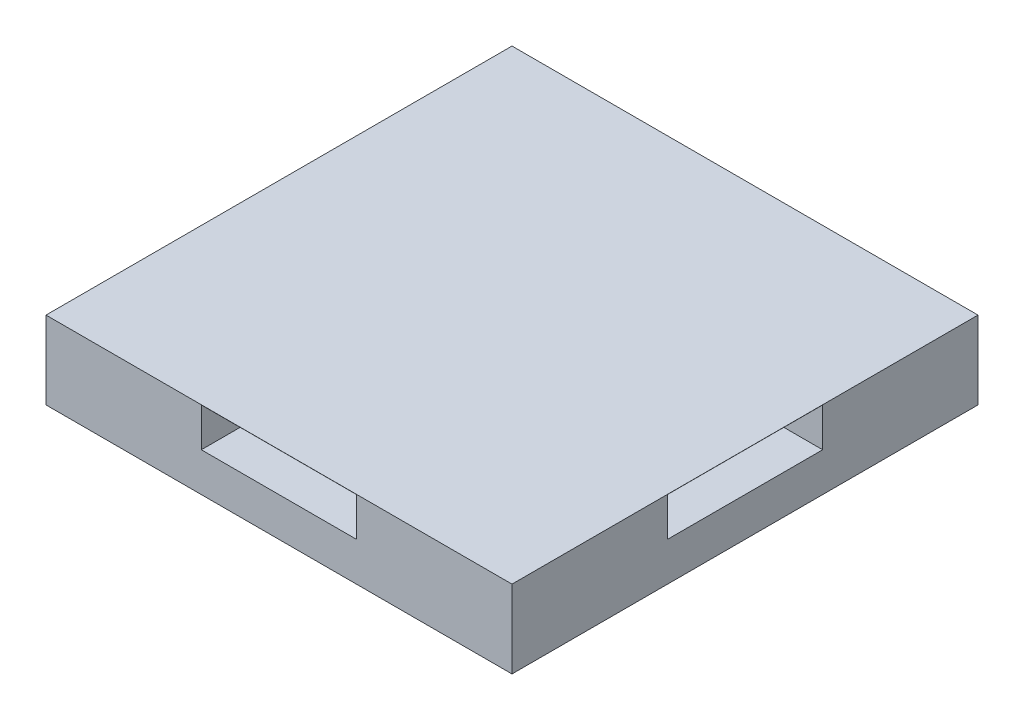
ISO-10303-21;
HEADER;
FILE_DESCRIPTION(('STEP AP214'),'2;1');
FILE_NAME('part.step','',(''),(''),'','','');
FILE_SCHEMA(('AUTOMOTIVE_DESIGN { 1 0 10303 214 1 1 1 1 }'));
ENDSEC;
DATA;
#1=APPLICATION_CONTEXT('core data for automotive mechanical design processes');
#2=APPLICATION_PROTOCOL_DEFINITION('international standard','automotive_design',2000,#1);
#3=PRODUCT_CONTEXT('',#1,'mechanical');
#4=PRODUCT('Part','Part','',(#3));
#5=PRODUCT_RELATED_PRODUCT_CATEGORY('part','',(#4));
#6=PRODUCT_DEFINITION_FORMATION('','',#4);
#7=PRODUCT_DEFINITION_CONTEXT('part definition',#1,'design');
#8=PRODUCT_DEFINITION('design','',#6,#7);
#9=PRODUCT_DEFINITION_SHAPE('','',#8);
#10=(LENGTH_UNIT() NAMED_UNIT(*) SI_UNIT(.MILLI.,.METRE.));
#11=(NAMED_UNIT(*) PLANE_ANGLE_UNIT() SI_UNIT($,.RADIAN.));
#12=(NAMED_UNIT(*) SI_UNIT($,.STERADIAN.) SOLID_ANGLE_UNIT());
#13=UNCERTAINTY_MEASURE_WITH_UNIT(LENGTH_MEASURE(1.E-05),#10,'distance_accuracy_value','');
#14=(GEOMETRIC_REPRESENTATION_CONTEXT(3) GLOBAL_UNCERTAINTY_ASSIGNED_CONTEXT((#13)) GLOBAL_UNIT_ASSIGNED_CONTEXT((#10,
#11,#12)) REPRESENTATION_CONTEXT('',''));
#15=CARTESIAN_POINT('',(0.,0.,0.));
#16=DIRECTION('',(0.,0.,1.));
#17=DIRECTION('',(1.,0.,0.));
#18=AXIS2_PLACEMENT_3D('',#15,#16,#17);
#19=CARTESIAN_POINT('',(0.,12.7,0.));
#20=DIRECTION('',(1.,0.,0.));
#21=DIRECTION('',(0.,0.,-1.));
#22=AXIS2_PLACEMENT_3D('',#19,#20,#21);
#23=PLANE('',#22);
#24=DIRECTION('',(0.,1.,0.));
#25=VECTOR('',#24,1.);
#26=CARTESIAN_POINT('',(0.,6.35,-50.8));
#27=LINE('',#26,#25);
#28=CARTESIAN_POINT('',(0.,6.35,-50.8));
#29=VERTEX_POINT('',#28);
#30=CARTESIAN_POINT('',(0.,12.7,-50.8));
#31=VERTEX_POINT('',#30);
#32=EDGE_CURVE('E255',#29,#31,#27,.T.);
#33=ORIENTED_EDGE('',*,*,#32,.T.);
#34=DIRECTION('',(0.,0.,1.));
#35=VECTOR('',#34,1.);
#36=CARTESIAN_POINT('',(0.,12.7,-76.2));
#37=LINE('',#36,#35);
#38=CARTESIAN_POINT('',(0.,12.7,-25.4));
#39=VERTEX_POINT('',#38);
#40=EDGE_CURVE('E203',#31,#39,#37,.T.);
#41=ORIENTED_EDGE('',*,*,#40,.T.);
#42=DIRECTION('',(0.,1.,0.));
#43=VECTOR('',#42,1.);
#44=CARTESIAN_POINT('',(0.,6.35,-25.4));
#45=LINE('',#44,#43);
#46=CARTESIAN_POINT('',(0.,6.35,-25.4));
#47=VERTEX_POINT('',#46);
#48=EDGE_CURVE('E245',#47,#39,#45,.T.);
#49=ORIENTED_EDGE('',*,*,#48,.F.);
#50=DIRECTION('',(0.,0.,1.));
#51=VECTOR('',#50,1.);
#52=CARTESIAN_POINT('',(0.,6.35,-50.8));
#53=LINE('',#52,#51);
#54=EDGE_CURVE('E263',#29,#47,#53,.T.);
#55=ORIENTED_EDGE('',*,*,#54,.F.);
#56=EDGE_LOOP('',(#33,#41,#49,#55));
#57=FACE_BOUND('',#56,.T.);
#58=DIRECTION('',(0.,0.,1.));
#59=VECTOR('',#58,1.);
#60=CARTESIAN_POINT('',(0.,12.7254,-76.2));
#61=LINE('',#60,#59);
#62=CARTESIAN_POINT('',(0.,12.7254,-76.2));
#63=VERTEX_POINT('',#62);
#64=CARTESIAN_POINT('',(0.,12.7254,0.));
#65=VERTEX_POINT('',#64);
#66=EDGE_CURVE('E178',#63,#65,#61,.T.);
#67=ORIENTED_EDGE('',*,*,#66,.F.);
#68=DIRECTION('',(0.,-1.,0.));
#69=VECTOR('',#68,1.);
#70=CARTESIAN_POINT('',(0.,12.7,-76.2));
#71=LINE('',#70,#69);
#72=CARTESIAN_POINT('',(0.,0.,-76.2));
#73=VERTEX_POINT('',#72);
#74=EDGE_CURVE('E347',#63,#73,#71,.T.);
#75=ORIENTED_EDGE('',*,*,#74,.T.);
#76=DIRECTION('',(0.,0.,1.));
#77=VECTOR('',#76,1.);
#78=CARTESIAN_POINT('',(0.,0.,0.));
#79=LINE('',#78,#77);
#80=CARTESIAN_POINT('',(0.,0.,0.));
#81=VERTEX_POINT('',#80);
#82=EDGE_CURVE('E180',#73,#81,#79,.T.);
#83=ORIENTED_EDGE('',*,*,#82,.T.);
#84=DIRECTION('',(0.,-1.,0.));
#85=VECTOR('',#84,1.);
#86=CARTESIAN_POINT('',(0.,12.7,0.));
#87=LINE('',#86,#85);
#88=EDGE_CURVE('E11',#65,#81,#87,.T.);
#89=ORIENTED_EDGE('',*,*,#88,.F.);
#90=EDGE_LOOP('',(#67,#75,#83,#89));
#91=FACE_BOUND('',#90,.T.);
#92=ADVANCED_FACE('F39',(#57,#91),#23,.F.);
#93=CARTESIAN_POINT('',(0.,12.7,0.));
#94=DIRECTION('',(0.,0.,-1.));
#95=DIRECTION('',(-1.,0.,0.));
#96=AXIS2_PLACEMENT_3D('',#93,#94,#95);
#97=PLANE('',#96);
#98=DIRECTION('',(0.,1.,0.));
#99=VECTOR('',#98,1.);
#100=CARTESIAN_POINT('',(25.4,6.35,0.));
#101=LINE('',#100,#99);
#102=CARTESIAN_POINT('',(25.4,6.35,0.));
#103=VERTEX_POINT('',#102);
#104=CARTESIAN_POINT('',(25.4,12.7,0.));
#105=VERTEX_POINT('',#104);
#106=EDGE_CURVE('E278',#103,#105,#101,.T.);
#107=ORIENTED_EDGE('',*,*,#106,.T.);
#108=DIRECTION('',(1.,0.,0.));
#109=VECTOR('',#108,1.);
#110=CARTESIAN_POINT('',(0.,12.7,0.));
#111=LINE('',#110,#109);
#112=CARTESIAN_POINT('',(50.8,12.7,0.));
#113=VERTEX_POINT('',#112);
#114=EDGE_CURVE('E206',#105,#113,#111,.T.);
#115=ORIENTED_EDGE('',*,*,#114,.T.);
#116=DIRECTION('',(0.,1.,0.));
#117=VECTOR('',#116,1.);
#118=CARTESIAN_POINT('',(50.8,6.35,0.));
#119=LINE('',#118,#117);
#120=CARTESIAN_POINT('',(50.8,6.35,0.));
#121=VERTEX_POINT('',#120);
#122=EDGE_CURVE('E282',#121,#113,#119,.T.);
#123=ORIENTED_EDGE('',*,*,#122,.F.);
#124=DIRECTION('',(1.,0.,0.));
#125=VECTOR('',#124,1.);
#126=CARTESIAN_POINT('',(25.4,6.35,0.));
#127=LINE('',#126,#125);
#128=EDGE_CURVE('E306',#103,#121,#127,.T.);
#129=ORIENTED_EDGE('',*,*,#128,.F.);
#130=EDGE_LOOP('',(#107,#115,#123,#129));
#131=FACE_BOUND('',#130,.T.);
#132=DIRECTION('',(1.,0.,0.));
#133=VECTOR('',#132,1.);
#134=CARTESIAN_POINT('',(0.,12.7254,0.));
#135=LINE('',#134,#133);
#136=CARTESIAN_POINT('',(76.2,12.7254,0.));
#137=VERTEX_POINT('',#136);
#138=EDGE_CURVE('E183',#65,#137,#135,.T.);
#139=ORIENTED_EDGE('',*,*,#138,.F.);
#140=ORIENTED_EDGE('',*,*,#88,.T.);
#141=DIRECTION('',(1.,0.,0.));
#142=VECTOR('',#141,1.);
#143=CARTESIAN_POINT('',(0.,0.,0.));
#144=LINE('',#143,#142);
#145=CARTESIAN_POINT('',(76.2,0.,0.));
#146=VERTEX_POINT('',#145);
#147=EDGE_CURVE('E343',#81,#146,#144,.T.);
#148=ORIENTED_EDGE('',*,*,#147,.T.);
#149=DIRECTION('',(0.,-1.,0.));
#150=VECTOR('',#149,1.);
#151=CARTESIAN_POINT('',(76.2,12.7,0.));
#152=LINE('',#151,#150);
#153=EDGE_CURVE('E46',#137,#146,#152,.T.);
#154=ORIENTED_EDGE('',*,*,#153,.F.);
#155=EDGE_LOOP('',(#139,#140,#148,#154));
#156=FACE_BOUND('',#155,.T.);
#157=ADVANCED_FACE('F184',(#131,#156),#97,.F.);
#158=CARTESIAN_POINT('',(76.2,12.7,0.));
#159=DIRECTION('',(-1.,0.,0.));
#160=DIRECTION('',(0.,0.,1.));
#161=AXIS2_PLACEMENT_3D('',#158,#159,#160);
#162=PLANE('',#161);
#163=DIRECTION('',(0.,1.,0.));
#164=VECTOR('',#163,1.);
#165=CARTESIAN_POINT('',(76.2,6.35,-25.4));
#166=LINE('',#165,#164);
#167=CARTESIAN_POINT('',(76.2,6.35,-25.4));
#168=VERTEX_POINT('',#167);
#169=CARTESIAN_POINT('',(76.2,12.7,-25.4));
#170=VERTEX_POINT('',#169);
#171=EDGE_CURVE('E202',#168,#170,#166,.T.);
#172=ORIENTED_EDGE('',*,*,#171,.T.);
#173=DIRECTION('',(0.,0.,-1.));
#174=VECTOR('',#173,1.);
#175=CARTESIAN_POINT('',(76.2,12.7,-76.2));
#176=LINE('',#175,#174);
#177=CARTESIAN_POINT('',(76.2,12.7,-50.8));
#178=VERTEX_POINT('',#177);
#179=EDGE_CURVE('E197',#170,#178,#176,.T.);
#180=ORIENTED_EDGE('',*,*,#179,.T.);
#181=DIRECTION('',(0.,1.,0.));
#182=VECTOR('',#181,1.);
#183=CARTESIAN_POINT('',(76.2,6.35,-50.8));
#184=LINE('',#183,#182);
#185=CARTESIAN_POINT('',(76.2,6.35,-50.8));
#186=VERTEX_POINT('',#185);
#187=EDGE_CURVE('E311',#186,#178,#184,.T.);
#188=ORIENTED_EDGE('',*,*,#187,.F.);
#189=DIRECTION('',(0.,0.,-1.));
#190=VECTOR('',#189,1.);
#191=CARTESIAN_POINT('',(76.2,6.35,-50.8));
#192=LINE('',#191,#190);
#193=EDGE_CURVE('E327',#168,#186,#192,.T.);
#194=ORIENTED_EDGE('',*,*,#193,.F.);
#195=EDGE_LOOP('',(#172,#180,#188,#194));
#196=FACE_BOUND('',#195,.T.);
#197=DIRECTION('',(0.,0.,-1.));
#198=VECTOR('',#197,1.);
#199=CARTESIAN_POINT('',(76.2,12.7254,-76.2));
#200=LINE('',#199,#198);
#201=CARTESIAN_POINT('',(76.2,12.7254,-76.2));
#202=VERTEX_POINT('',#201);
#203=EDGE_CURVE('E188',#137,#202,#200,.T.);
#204=ORIENTED_EDGE('',*,*,#203,.F.);
#205=ORIENTED_EDGE('',*,*,#153,.T.);
#206=DIRECTION('',(0.,0.,-1.));
#207=VECTOR('',#206,1.);
#208=CARTESIAN_POINT('',(76.2,0.,0.));
#209=LINE('',#208,#207);
#210=CARTESIAN_POINT('',(76.2,0.,-76.2));
#211=VERTEX_POINT('',#210);
#212=EDGE_CURVE('E61',#146,#211,#209,.T.);
#213=ORIENTED_EDGE('',*,*,#212,.T.);
#214=DIRECTION('',(0.,-1.,0.));
#215=VECTOR('',#214,1.);
#216=CARTESIAN_POINT('',(76.2,12.7,-76.2));
#217=LINE('',#216,#215);
#218=EDGE_CURVE('E349',#202,#211,#217,.T.);
#219=ORIENTED_EDGE('',*,*,#218,.F.);
#220=EDGE_LOOP('',(#204,#205,#213,#219));
#221=FACE_BOUND('',#220,.T.);
#222=ADVANCED_FACE('F350',(#196,#221),#162,.F.);
#223=CARTESIAN_POINT('',(0.,12.7,-76.2));
#224=DIRECTION('',(0.,0.,1.));
#225=DIRECTION('',(1.,0.,0.));
#226=AXIS2_PLACEMENT_3D('',#223,#224,#225);
#227=PLANE('',#226);
#228=ORIENTED_EDGE('',*,*,#74,.F.);
#229=DIRECTION('',(-1.,0.,0.));
#230=VECTOR('',#229,1.);
#231=CARTESIAN_POINT('',(0.,12.7254,-76.2));
#232=LINE('',#231,#230);
#233=EDGE_CURVE('E193',#202,#63,#232,.T.);
#234=ORIENTED_EDGE('',*,*,#233,.F.);
#235=ORIENTED_EDGE('',*,*,#218,.T.);
#236=DIRECTION('',(-1.,0.,0.));
#237=VECTOR('',#236,1.);
#238=CARTESIAN_POINT('',(0.,0.,-76.2));
#239=LINE('',#238,#237);
#240=EDGE_CURVE('E53',#211,#73,#239,.T.);
#241=ORIENTED_EDGE('',*,*,#240,.T.);
#242=EDGE_LOOP('',(#228,#234,#235,#241));
#243=FACE_BOUND('',#242,.T.);
#244=DIRECTION('',(-1.,0.,0.));
#245=VECTOR('',#244,1.);
#246=CARTESIAN_POINT('',(0.,12.7,-76.2));
#247=LINE('',#246,#245);
#248=CARTESIAN_POINT('',(50.8,12.7,-76.2));
#249=VERTEX_POINT('',#248);
#250=CARTESIAN_POINT('',(25.4,12.7,-76.2));
#251=VERTEX_POINT('',#250);
#252=EDGE_CURVE('E194',#249,#251,#247,.T.);
#253=ORIENTED_EDGE('',*,*,#252,.T.);
#254=DIRECTION('',(0.,1.,0.));
#255=VECTOR('',#254,1.);
#256=CARTESIAN_POINT('',(25.4,6.35,-76.2));
#257=LINE('',#256,#255);
#258=CARTESIAN_POINT('',(25.4,6.35,-76.2));
#259=VERTEX_POINT('',#258);
#260=EDGE_CURVE('E234',#259,#251,#257,.T.);
#261=ORIENTED_EDGE('',*,*,#260,.F.);
#262=DIRECTION('',(-1.,0.,0.));
#263=VECTOR('',#262,1.);
#264=CARTESIAN_POINT('',(25.4,6.35,-76.2));
#265=LINE('',#264,#263);
#266=CARTESIAN_POINT('',(50.8,6.35,-76.2));
#267=VERTEX_POINT('',#266);
#268=EDGE_CURVE('E221',#267,#259,#265,.T.);
#269=ORIENTED_EDGE('',*,*,#268,.F.);
#270=DIRECTION('',(0.,1.,0.));
#271=VECTOR('',#270,1.);
#272=CARTESIAN_POINT('',(50.8,6.35,-76.2));
#273=LINE('',#272,#271);
#274=EDGE_CURVE('E237',#267,#249,#273,.T.);
#275=ORIENTED_EDGE('',*,*,#274,.T.);
#276=EDGE_LOOP('',(#253,#261,#269,#275));
#277=FACE_BOUND('',#276,.T.);
#278=ADVANCED_FACE('F355',(#243,#277),#227,.F.);
#279=CARTESIAN_POINT('',(0.,0.,0.));
#280=DIRECTION('',(0.,-1.,0.));
#281=DIRECTION('',(0.,0.,-1.));
#282=AXIS2_PLACEMENT_3D('',#279,#280,#281);
#283=PLANE('',#282);
#284=ORIENTED_EDGE('',*,*,#82,.F.);
#285=ORIENTED_EDGE('',*,*,#240,.F.);
#286=ORIENTED_EDGE('',*,*,#212,.F.);
#287=ORIENTED_EDGE('',*,*,#147,.F.);
#288=EDGE_LOOP('',(#284,#285,#286,#287));
#289=FACE_BOUND('',#288,.T.);
#290=ADVANCED_FACE('F352',(#289),#283,.T.);
#291=CARTESIAN_POINT('',(76.2,6.35,-25.4));
#292=DIRECTION('',(0.,0.,1.));
#293=DIRECTION('',(1.,0.,0.));
#294=AXIS2_PLACEMENT_3D('',#291,#292,#293);
#295=PLANE('',#294);
#296=DIRECTION('',(1.,0.,0.));
#297=VECTOR('',#296,1.);
#298=CARTESIAN_POINT('',(76.2,12.7,-25.4));
#299=LINE('',#298,#297);
#300=CARTESIAN_POINT('',(65.786,12.7,-25.4));
#301=VERTEX_POINT('',#300);
#302=EDGE_CURVE('E323',#301,#170,#299,.T.);
#303=ORIENTED_EDGE('',*,*,#302,.T.);
#304=ORIENTED_EDGE('',*,*,#171,.F.);
#305=DIRECTION('',(1.,0.,0.));
#306=VECTOR('',#305,1.);
#307=CARTESIAN_POINT('',(76.2,6.35,-25.4));
#308=LINE('',#307,#306);
#309=CARTESIAN_POINT('',(65.786,6.35,-25.4));
#310=VERTEX_POINT('',#309);
#311=EDGE_CURVE('E314',#310,#168,#308,.T.);
#312=ORIENTED_EDGE('',*,*,#311,.F.);
#313=DIRECTION('',(0.,1.,0.));
#314=VECTOR('',#313,1.);
#315=CARTESIAN_POINT('',(65.786,6.35,-25.4));
#316=LINE('',#315,#314);
#317=EDGE_CURVE('E318',#310,#301,#316,.T.);
#318=ORIENTED_EDGE('',*,*,#317,.T.);
#319=EDGE_LOOP('',(#303,#304,#312,#318));
#320=FACE_BOUND('',#319,.T.);
#321=ADVANCED_FACE('F354',(#320),#295,.F.);
#322=CARTESIAN_POINT('',(65.786,6.35,-50.8));
#323=DIRECTION('',(-1.,0.,0.));
#324=DIRECTION('',(0.,0.,1.));
#325=AXIS2_PLACEMENT_3D('',#322,#323,#324);
#326=PLANE('',#325);
#327=DIRECTION('',(0.,0.,1.));
#328=VECTOR('',#327,1.);
#329=CARTESIAN_POINT('',(65.786,12.7,-50.8));
#330=LINE('',#329,#328);
#331=CARTESIAN_POINT('',(65.786,12.7,-50.8));
#332=VERTEX_POINT('',#331);
#333=EDGE_CURVE('E326',#332,#301,#330,.T.);
#334=ORIENTED_EDGE('',*,*,#333,.T.);
#335=ORIENTED_EDGE('',*,*,#317,.F.);
#336=DIRECTION('',(0.,0.,1.));
#337=VECTOR('',#336,1.);
#338=CARTESIAN_POINT('',(65.786,6.35,-50.8));
#339=LINE('',#338,#337);
#340=CARTESIAN_POINT('',(65.786,6.35,-50.8));
#341=VERTEX_POINT('',#340);
#342=EDGE_CURVE('E334',#341,#310,#339,.T.);
#343=ORIENTED_EDGE('',*,*,#342,.F.);
#344=DIRECTION('',(0.,1.,0.));
#345=VECTOR('',#344,1.);
#346=CARTESIAN_POINT('',(65.786,6.35,-50.8));
#347=LINE('',#346,#345);
#348=EDGE_CURVE('E315',#341,#332,#347,.T.);
#349=ORIENTED_EDGE('',*,*,#348,.T.);
#350=EDGE_LOOP('',(#334,#335,#343,#349));
#351=FACE_BOUND('',#350,.T.);
#352=ADVANCED_FACE('F361',(#351),#326,.F.);
#353=CARTESIAN_POINT('',(76.2,6.35,-50.8));
#354=DIRECTION('',(0.,0.,-1.));
#355=DIRECTION('',(-1.,0.,0.));
#356=AXIS2_PLACEMENT_3D('',#353,#354,#355);
#357=PLANE('',#356);
#358=DIRECTION('',(-1.,0.,0.));
#359=VECTOR('',#358,1.);
#360=CARTESIAN_POINT('',(76.2,12.7,-50.8));
#361=LINE('',#360,#359);
#362=EDGE_CURVE('E291',#178,#332,#361,.T.);
#363=ORIENTED_EDGE('',*,*,#362,.T.);
#364=ORIENTED_EDGE('',*,*,#348,.F.);
#365=DIRECTION('',(-1.,0.,0.));
#366=VECTOR('',#365,1.);
#367=CARTESIAN_POINT('',(76.2,6.35,-50.8));
#368=LINE('',#367,#366);
#369=EDGE_CURVE('E337',#186,#341,#368,.T.);
#370=ORIENTED_EDGE('',*,*,#369,.F.);
#371=ORIENTED_EDGE('',*,*,#187,.T.);
#372=EDGE_LOOP('',(#363,#364,#370,#371));
#373=FACE_BOUND('',#372,.T.);
#374=ADVANCED_FACE('F417',(#373),#357,.F.);
#375=CARTESIAN_POINT('',(0.,6.35,0.));
#376=DIRECTION('',(0.,-1.,0.));
#377=DIRECTION('',(0.,0.,-1.));
#378=AXIS2_PLACEMENT_3D('',#375,#376,#377);
#379=PLANE('',#378);
#380=ORIENTED_EDGE('',*,*,#193,.T.);
#381=ORIENTED_EDGE('',*,*,#369,.T.);
#382=ORIENTED_EDGE('',*,*,#342,.T.);
#383=ORIENTED_EDGE('',*,*,#311,.T.);
#384=EDGE_LOOP('',(#380,#381,#382,#383));
#385=FACE_BOUND('',#384,.T.);
#386=ADVANCED_FACE('F405',(#385),#379,.F.);
#387=CARTESIAN_POINT('',(25.4,6.35,0.));
#388=DIRECTION('',(-1.,0.,0.));
#389=DIRECTION('',(0.,0.,1.));
#390=AXIS2_PLACEMENT_3D('',#387,#388,#389);
#391=PLANE('',#390);
#392=DIRECTION('',(0.,0.,1.));
#393=VECTOR('',#392,1.);
#394=CARTESIAN_POINT('',(25.4,12.7,0.));
#395=LINE('',#394,#393);
#396=CARTESIAN_POINT('',(25.4,12.7,-10.414));
#397=VERTEX_POINT('',#396);
#398=EDGE_CURVE('E258',#397,#105,#395,.T.);
#399=ORIENTED_EDGE('',*,*,#398,.T.);
#400=ORIENTED_EDGE('',*,*,#106,.F.);
#401=DIRECTION('',(0.,0.,1.));
#402=VECTOR('',#401,1.);
#403=CARTESIAN_POINT('',(25.4,6.35,0.));
#404=LINE('',#403,#402);
#405=CARTESIAN_POINT('',(25.4,6.35,-10.414));
#406=VERTEX_POINT('',#405);
#407=EDGE_CURVE('E296',#406,#103,#404,.T.);
#408=ORIENTED_EDGE('',*,*,#407,.F.);
#409=DIRECTION('',(0.,1.,0.));
#410=VECTOR('',#409,1.);
#411=CARTESIAN_POINT('',(25.4,6.35,-10.414));
#412=LINE('',#411,#410);
#413=EDGE_CURVE('E288',#406,#397,#412,.T.);
#414=ORIENTED_EDGE('',*,*,#413,.T.);
#415=EDGE_LOOP('',(#399,#400,#408,#414));
#416=FACE_BOUND('',#415,.T.);
#417=ADVANCED_FACE('F401',(#416),#391,.F.);
#418=CARTESIAN_POINT('',(25.4,6.35,-10.414));
#419=DIRECTION('',(0.,0.,-1.));
#420=DIRECTION('',(-1.,0.,0.));
#421=AXIS2_PLACEMENT_3D('',#418,#419,#420);
#422=PLANE('',#421);
#423=DIRECTION('',(-1.,0.,0.));
#424=VECTOR('',#423,1.);
#425=CARTESIAN_POINT('',(25.4,12.7,-10.414));
#426=LINE('',#425,#424);
#427=CARTESIAN_POINT('',(50.8,12.7,-10.414));
#428=VERTEX_POINT('',#427);
#429=EDGE_CURVE('E292',#428,#397,#426,.T.);
#430=ORIENTED_EDGE('',*,*,#429,.T.);
#431=ORIENTED_EDGE('',*,*,#413,.F.);
#432=DIRECTION('',(-1.,0.,0.));
#433=VECTOR('',#432,1.);
#434=CARTESIAN_POINT('',(25.4,6.35,-10.414));
#435=LINE('',#434,#433);
#436=CARTESIAN_POINT('',(50.8,6.35,-10.414));
#437=VERTEX_POINT('',#436);
#438=EDGE_CURVE('E281',#437,#406,#435,.T.);
#439=ORIENTED_EDGE('',*,*,#438,.F.);
#440=DIRECTION('',(0.,1.,0.));
#441=VECTOR('',#440,1.);
#442=CARTESIAN_POINT('',(50.8,6.35,-10.414));
#443=LINE('',#442,#441);
#444=EDGE_CURVE('E285',#437,#428,#443,.T.);
#445=ORIENTED_EDGE('',*,*,#444,.T.);
#446=EDGE_LOOP('',(#430,#431,#439,#445));
#447=FACE_BOUND('',#446,.T.);
#448=ADVANCED_FACE('F404',(#447),#422,.F.);
#449=CARTESIAN_POINT('',(50.8,6.35,0.));
#450=DIRECTION('',(1.,0.,0.));
#451=DIRECTION('',(0.,0.,-1.));
#452=AXIS2_PLACEMENT_3D('',#449,#450,#451);
#453=PLANE('',#452);
#454=DIRECTION('',(0.,0.,-1.));
#455=VECTOR('',#454,1.);
#456=CARTESIAN_POINT('',(50.8,12.7,0.));
#457=LINE('',#456,#455);
#458=EDGE_CURVE('E295',#113,#428,#457,.T.);
#459=ORIENTED_EDGE('',*,*,#458,.T.);
#460=ORIENTED_EDGE('',*,*,#444,.F.);
#461=DIRECTION('',(0.,0.,-1.));
#462=VECTOR('',#461,1.);
#463=CARTESIAN_POINT('',(50.8,6.35,0.));
#464=LINE('',#463,#462);
#465=EDGE_CURVE('E303',#121,#437,#464,.T.);
#466=ORIENTED_EDGE('',*,*,#465,.F.);
#467=ORIENTED_EDGE('',*,*,#122,.T.);
#468=EDGE_LOOP('',(#459,#460,#466,#467));
#469=FACE_BOUND('',#468,.T.);
#470=ADVANCED_FACE('F407',(#469),#453,.F.);
#471=CARTESIAN_POINT('',(0.,6.35,0.));
#472=DIRECTION('',(0.,-1.,0.));
#473=DIRECTION('',(0.,0.,-1.));
#474=AXIS2_PLACEMENT_3D('',#471,#472,#473);
#475=PLANE('',#474);
#476=ORIENTED_EDGE('',*,*,#407,.T.);
#477=ORIENTED_EDGE('',*,*,#128,.T.);
#478=ORIENTED_EDGE('',*,*,#465,.T.);
#479=ORIENTED_EDGE('',*,*,#438,.T.);
#480=EDGE_LOOP('',(#476,#477,#478,#479));
#481=FACE_BOUND('',#480,.T.);
#482=ADVANCED_FACE('F399',(#481),#475,.F.);
#483=CARTESIAN_POINT('',(0.,6.35,-50.8));
#484=DIRECTION('',(0.,0.,-1.));
#485=DIRECTION('',(-1.,0.,0.));
#486=AXIS2_PLACEMENT_3D('',#483,#484,#485);
#487=PLANE('',#486);
#488=DIRECTION('',(-1.,0.,0.));
#489=VECTOR('',#488,1.);
#490=CARTESIAN_POINT('',(0.,12.7,-50.8));
#491=LINE('',#490,#489);
#492=CARTESIAN_POINT('',(10.414,12.7,-50.8));
#493=VERTEX_POINT('',#492);
#494=EDGE_CURVE('E259',#493,#31,#491,.T.);
#495=ORIENTED_EDGE('',*,*,#494,.T.);
#496=ORIENTED_EDGE('',*,*,#32,.F.);
#497=DIRECTION('',(-1.,0.,0.));
#498=VECTOR('',#497,1.);
#499=CARTESIAN_POINT('',(0.,6.35,-50.8));
#500=LINE('',#499,#498);
#501=CARTESIAN_POINT('',(10.414,6.35,-50.8));
#502=VERTEX_POINT('',#501);
#503=EDGE_CURVE('E248',#502,#29,#500,.T.);
#504=ORIENTED_EDGE('',*,*,#503,.F.);
#505=DIRECTION('',(0.,1.,0.));
#506=VECTOR('',#505,1.);
#507=CARTESIAN_POINT('',(10.414,6.35,-50.8));
#508=LINE('',#507,#506);
#509=EDGE_CURVE('E252',#502,#493,#508,.T.);
#510=ORIENTED_EDGE('',*,*,#509,.T.);
#511=EDGE_LOOP('',(#495,#496,#504,#510));
#512=FACE_BOUND('',#511,.T.);
#513=ADVANCED_FACE('F376',(#512),#487,.F.);
#514=CARTESIAN_POINT('',(10.414,6.35,-50.8));
#515=DIRECTION('',(1.,0.,0.));
#516=DIRECTION('',(0.,0.,-1.));
#517=AXIS2_PLACEMENT_3D('',#514,#515,#516);
#518=PLANE('',#517);
#519=DIRECTION('',(0.,0.,-1.));
#520=VECTOR('',#519,1.);
#521=CARTESIAN_POINT('',(10.414,12.7,-50.8));
#522=LINE('',#521,#520);
#523=CARTESIAN_POINT('',(10.414,12.7,-25.4));
#524=VERTEX_POINT('',#523);
#525=EDGE_CURVE('E262',#524,#493,#522,.T.);
#526=ORIENTED_EDGE('',*,*,#525,.T.);
#527=ORIENTED_EDGE('',*,*,#509,.F.);
#528=DIRECTION('',(0.,0.,-1.));
#529=VECTOR('',#528,1.);
#530=CARTESIAN_POINT('',(10.414,6.35,-50.8));
#531=LINE('',#530,#529);
#532=CARTESIAN_POINT('',(10.414,6.35,-25.4));
#533=VERTEX_POINT('',#532);
#534=EDGE_CURVE('E270',#533,#502,#531,.T.);
#535=ORIENTED_EDGE('',*,*,#534,.F.);
#536=DIRECTION('',(0.,1.,0.));
#537=VECTOR('',#536,1.);
#538=CARTESIAN_POINT('',(10.414,6.35,-25.4));
#539=LINE('',#538,#537);
#540=EDGE_CURVE('E249',#533,#524,#539,.T.);
#541=ORIENTED_EDGE('',*,*,#540,.T.);
#542=EDGE_LOOP('',(#526,#527,#535,#541));
#543=FACE_BOUND('',#542,.T.);
#544=ADVANCED_FACE('F381',(#543),#518,.F.);
#545=CARTESIAN_POINT('',(0.,6.35,-25.4));
#546=DIRECTION('',(0.,0.,1.));
#547=DIRECTION('',(1.,0.,0.));
#548=AXIS2_PLACEMENT_3D('',#545,#546,#547);
#549=PLANE('',#548);
#550=DIRECTION('',(1.,0.,0.));
#551=VECTOR('',#550,1.);
#552=CARTESIAN_POINT('',(0.,12.7,-25.4));
#553=LINE('',#552,#551);
#554=EDGE_CURVE('E229',#39,#524,#553,.T.);
#555=ORIENTED_EDGE('',*,*,#554,.T.);
#556=ORIENTED_EDGE('',*,*,#540,.F.);
#557=DIRECTION('',(1.,0.,0.));
#558=VECTOR('',#557,1.);
#559=CARTESIAN_POINT('',(0.,6.35,-25.4));
#560=LINE('',#559,#558);
#561=EDGE_CURVE('E273',#47,#533,#560,.T.);
#562=ORIENTED_EDGE('',*,*,#561,.F.);
#563=ORIENTED_EDGE('',*,*,#48,.T.);
#564=EDGE_LOOP('',(#555,#556,#562,#563));
#565=FACE_BOUND('',#564,.T.);
#566=ADVANCED_FACE('F385',(#565),#549,.F.);
#567=CARTESIAN_POINT('',(0.,6.35,0.));
#568=DIRECTION('',(0.,1.,0.));
#569=DIRECTION('',(0.,0.,1.));
#570=AXIS2_PLACEMENT_3D('',#567,#568,#569);
#571=PLANE('',#570);
#572=ORIENTED_EDGE('',*,*,#54,.T.);
#573=ORIENTED_EDGE('',*,*,#561,.T.);
#574=ORIENTED_EDGE('',*,*,#534,.T.);
#575=ORIENTED_EDGE('',*,*,#503,.T.);
#576=EDGE_LOOP('',(#572,#573,#574,#575));
#577=FACE_BOUND('',#576,.T.);
#578=ADVANCED_FACE('F378',(#577),#571,.T.);
#579=CARTESIAN_POINT('',(25.4,6.35,-76.2));
#580=DIRECTION('',(-1.,0.,0.));
#581=DIRECTION('',(0.,0.,1.));
#582=AXIS2_PLACEMENT_3D('',#579,#580,#581);
#583=PLANE('',#582);
#584=DIRECTION('',(0.,0.,1.));
#585=VECTOR('',#584,1.);
#586=CARTESIAN_POINT('',(25.4,12.7,-76.2));
#587=LINE('',#586,#585);
#588=CARTESIAN_POINT('',(25.4,12.7,-65.786));
#589=VERTEX_POINT('',#588);
#590=EDGE_CURVE('E225',#251,#589,#587,.T.);
#591=ORIENTED_EDGE('',*,*,#590,.T.);
#592=DIRECTION('',(0.,1.,0.));
#593=VECTOR('',#592,1.);
#594=CARTESIAN_POINT('',(25.4,6.35,-65.786));
#595=LINE('',#594,#593);
#596=CARTESIAN_POINT('',(25.4,6.35,-65.786));
#597=VERTEX_POINT('',#596);
#598=EDGE_CURVE('E224',#597,#589,#595,.T.);
#599=ORIENTED_EDGE('',*,*,#598,.F.);
#600=DIRECTION('',(0.,0.,1.));
#601=VECTOR('',#600,1.);
#602=CARTESIAN_POINT('',(25.4,6.35,-76.2));
#603=LINE('',#602,#601);
#604=EDGE_CURVE('E211',#259,#597,#603,.T.);
#605=ORIENTED_EDGE('',*,*,#604,.F.);
#606=ORIENTED_EDGE('',*,*,#260,.T.);
#607=EDGE_LOOP('',(#591,#599,#605,#606));
#608=FACE_BOUND('',#607,.T.);
#609=ADVANCED_FACE('F392',(#608),#583,.F.);
#610=CARTESIAN_POINT('',(50.8,6.35,-76.2));
#611=DIRECTION('',(1.,0.,0.));
#612=DIRECTION('',(0.,0.,-1.));
#613=AXIS2_PLACEMENT_3D('',#610,#611,#612);
#614=PLANE('',#613);
#615=DIRECTION('',(0.,0.,-1.));
#616=VECTOR('',#615,1.);
#617=CARTESIAN_POINT('',(50.8,12.7,-76.2));
#618=LINE('',#617,#616);
#619=CARTESIAN_POINT('',(50.8,12.7,-65.786));
#620=VERTEX_POINT('',#619);
#621=EDGE_CURVE('E215',#620,#249,#618,.T.);
#622=ORIENTED_EDGE('',*,*,#621,.T.);
#623=ORIENTED_EDGE('',*,*,#274,.F.);
#624=DIRECTION('',(0.,0.,-1.));
#625=VECTOR('',#624,1.);
#626=CARTESIAN_POINT('',(50.8,6.35,-76.2));
#627=LINE('',#626,#625);
#628=CARTESIAN_POINT('',(50.8,6.35,-65.786));
#629=VERTEX_POINT('',#628);
#630=EDGE_CURVE('E218',#629,#267,#627,.T.);
#631=ORIENTED_EDGE('',*,*,#630,.F.);
#632=DIRECTION('',(0.,1.,0.));
#633=VECTOR('',#632,1.);
#634=CARTESIAN_POINT('',(50.8,6.35,-65.786));
#635=LINE('',#634,#633);
#636=EDGE_CURVE('E240',#629,#620,#635,.T.);
#637=ORIENTED_EDGE('',*,*,#636,.T.);
#638=EDGE_LOOP('',(#622,#623,#631,#637));
#639=FACE_BOUND('',#638,.T.);
#640=ADVANCED_FACE('F459',(#639),#614,.F.);
#641=CARTESIAN_POINT('',(25.4,6.35,-65.786));
#642=DIRECTION('',(0.,0.,1.));
#643=DIRECTION('',(1.,0.,0.));
#644=AXIS2_PLACEMENT_3D('',#641,#642,#643);
#645=PLANE('',#644);
#646=DIRECTION('',(1.,0.,0.));
#647=VECTOR('',#646,1.);
#648=CARTESIAN_POINT('',(25.4,12.7,-65.786));
#649=LINE('',#648,#647);
#650=EDGE_CURVE('E228',#589,#620,#649,.T.);
#651=ORIENTED_EDGE('',*,*,#650,.T.);
#652=ORIENTED_EDGE('',*,*,#636,.F.);
#653=DIRECTION('',(1.,0.,0.));
#654=VECTOR('',#653,1.);
#655=CARTESIAN_POINT('',(25.4,6.35,-65.786));
#656=LINE('',#655,#654);
#657=EDGE_CURVE('E214',#597,#629,#656,.T.);
#658=ORIENTED_EDGE('',*,*,#657,.F.);
#659=ORIENTED_EDGE('',*,*,#598,.T.);
#660=EDGE_LOOP('',(#651,#652,#658,#659));
#661=FACE_BOUND('',#660,.T.);
#662=ADVANCED_FACE('F454',(#661),#645,.F.);
#663=CARTESIAN_POINT('',(0.,6.35,0.));
#664=DIRECTION('',(0.,1.,0.));
#665=DIRECTION('',(0.,0.,1.));
#666=AXIS2_PLACEMENT_3D('',#663,#664,#665);
#667=PLANE('',#666);
#668=ORIENTED_EDGE('',*,*,#604,.T.);
#669=ORIENTED_EDGE('',*,*,#657,.T.);
#670=ORIENTED_EDGE('',*,*,#630,.T.);
#671=ORIENTED_EDGE('',*,*,#268,.T.);
#672=EDGE_LOOP('',(#668,#669,#670,#671));
#673=FACE_BOUND('',#672,.T.);
#674=ADVANCED_FACE('F450',(#673),#667,.T.);
#675=CARTESIAN_POINT('',(0.,12.7,0.));
#676=DIRECTION('',(0.,1.,0.));
#677=DIRECTION('',(0.,0.,1.));
#678=AXIS2_PLACEMENT_3D('',#675,#676,#677);
#679=PLANE('',#678);
#680=ORIENTED_EDGE('',*,*,#494,.F.);
#681=ORIENTED_EDGE('',*,*,#525,.F.);
#682=ORIENTED_EDGE('',*,*,#554,.F.);
#683=ORIENTED_EDGE('',*,*,#40,.F.);
#684=EDGE_LOOP('',(#680,#681,#682,#683));
#685=FACE_BOUND('',#684,.T.);
#686=ADVANCED_FACE('F383',(#685),#679,.F.);
#687=ORIENTED_EDGE('',*,*,#398,.F.);
#688=ORIENTED_EDGE('',*,*,#429,.F.);
#689=ORIENTED_EDGE('',*,*,#458,.F.);
#690=ORIENTED_EDGE('',*,*,#114,.F.);
#691=EDGE_LOOP('',(#687,#688,#689,#690));
#692=FACE_BOUND('',#691,.T.);
#693=ADVANCED_FACE('F435',(#692),#679,.F.);
#694=ORIENTED_EDGE('',*,*,#302,.F.);
#695=ORIENTED_EDGE('',*,*,#333,.F.);
#696=ORIENTED_EDGE('',*,*,#362,.F.);
#697=ORIENTED_EDGE('',*,*,#179,.F.);
#698=EDGE_LOOP('',(#694,#695,#696,#697));
#699=FACE_BOUND('',#698,.T.);
#700=ADVANCED_FACE('F433',(#699),#679,.F.);
#701=CARTESIAN_POINT('',(0.,12.7254,0.));
#702=DIRECTION('',(0.,1.,0.));
#703=DIRECTION('',(0.,0.,1.));
#704=AXIS2_PLACEMENT_3D('',#701,#702,#703);
#705=PLANE('',#704);
#706=ORIENTED_EDGE('',*,*,#66,.T.);
#707=ORIENTED_EDGE('',*,*,#138,.T.);
#708=ORIENTED_EDGE('',*,*,#203,.T.);
#709=ORIENTED_EDGE('',*,*,#233,.T.);
#710=EDGE_LOOP('',(#706,#707,#708,#709));
#711=FACE_BOUND('',#710,.T.);
#712=ADVANCED_FACE('F191',(#711),#705,.T.);
#713=ORIENTED_EDGE('',*,*,#590,.F.);
#714=ORIENTED_EDGE('',*,*,#252,.F.);
#715=ORIENTED_EDGE('',*,*,#621,.F.);
#716=ORIENTED_EDGE('',*,*,#650,.F.);
#717=EDGE_LOOP('',(#713,#714,#715,#716));
#718=FACE_BOUND('',#717,.T.);
#719=ADVANCED_FACE('F437',(#718),#679,.F.);
#720=CLOSED_SHELL('',(#92,#157,#222,#278,#290,#321,#352,#374,#386,#417,#448,#470,#482,#513,#544,
#566,#578,#609,#640,#662,#674,#686,#693,#700,#712,#719));
#721=MANIFOLD_SOLID_BREP('B2',#720);
#722=ADVANCED_BREP_SHAPE_REPRESENTATION('',(#18,#721),#14);
#723=SHAPE_DEFINITION_REPRESENTATION(#9,#722);
ENDSEC;
END-ISO-10303-21;
